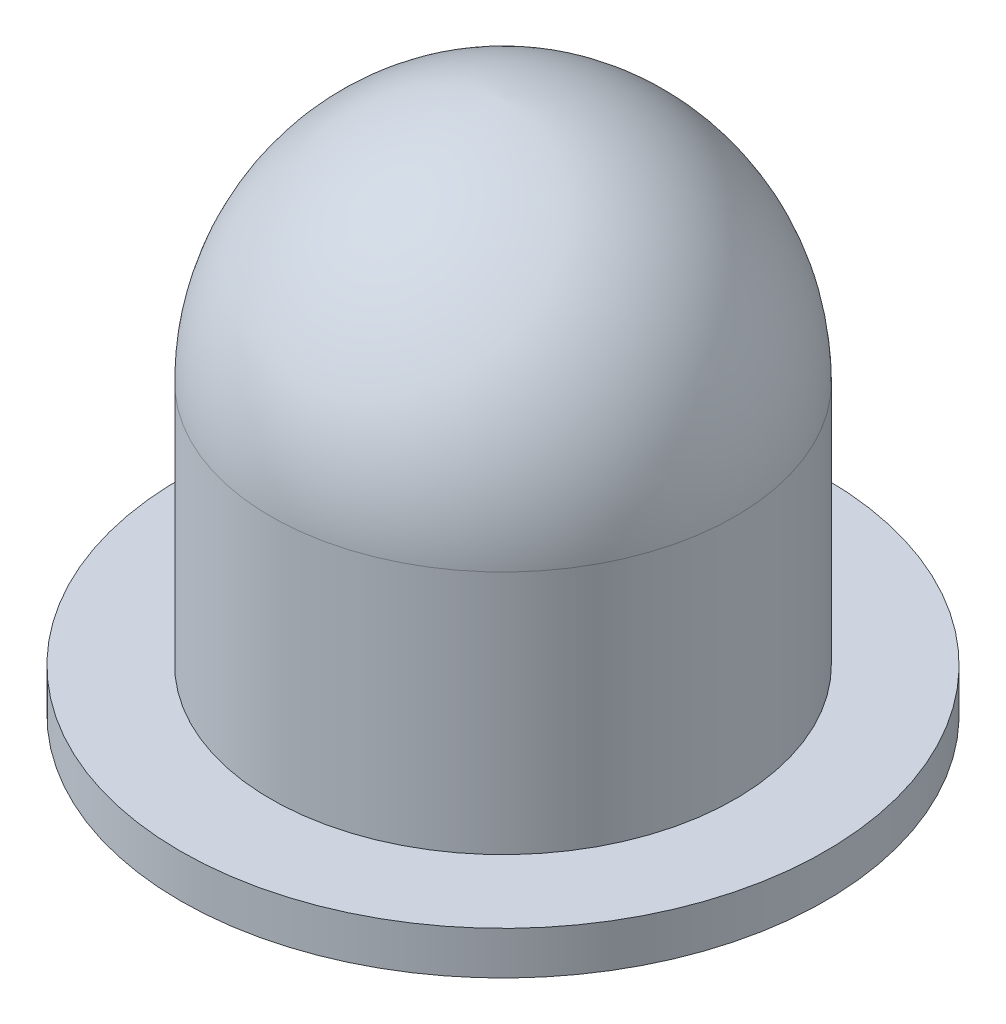
ISO-10303-21;
HEADER;
FILE_DESCRIPTION(('STEP AP214'),'2;1');
FILE_NAME('part.step','',(''),(''),'','','');
FILE_SCHEMA(('AUTOMOTIVE_DESIGN { 1 0 10303 214 1 1 1 1 }'));
ENDSEC;
DATA;
#1=APPLICATION_CONTEXT('core data for automotive mechanical design processes');
#2=APPLICATION_PROTOCOL_DEFINITION('international standard','automotive_design',2000,#1);
#3=PRODUCT_CONTEXT('',#1,'mechanical');
#4=PRODUCT('Part','Part','',(#3));
#5=PRODUCT_RELATED_PRODUCT_CATEGORY('part','',(#4));
#6=PRODUCT_DEFINITION_FORMATION('','',#4);
#7=PRODUCT_DEFINITION_CONTEXT('part definition',#1,'design');
#8=PRODUCT_DEFINITION('design','',#6,#7);
#9=PRODUCT_DEFINITION_SHAPE('','',#8);
#10=(LENGTH_UNIT() NAMED_UNIT(*) SI_UNIT(.MILLI.,.METRE.));
#11=(NAMED_UNIT(*) PLANE_ANGLE_UNIT() SI_UNIT($,.RADIAN.));
#12=(NAMED_UNIT(*) SI_UNIT($,.STERADIAN.) SOLID_ANGLE_UNIT());
#13=UNCERTAINTY_MEASURE_WITH_UNIT(LENGTH_MEASURE(1.E-05),#10,'distance_accuracy_value','');
#14=(GEOMETRIC_REPRESENTATION_CONTEXT(3) GLOBAL_UNCERTAINTY_ASSIGNED_CONTEXT((#13)) GLOBAL_UNIT_ASSIGNED_CONTEXT((#10,
#11,#12)) REPRESENTATION_CONTEXT('',''));
#15=CARTESIAN_POINT('',(0.,0.,0.));
#16=DIRECTION('',(0.,0.,1.));
#17=DIRECTION('',(1.,0.,0.));
#18=AXIS2_PLACEMENT_3D('',#15,#16,#17);
#19=CARTESIAN_POINT('',(0.,48.8417574380002,2.01415848401245));
#20=DIRECTION('',(-1.,0.,0.));
#21=DIRECTION('',(0.,0.,-1.));
#22=AXIS2_PLACEMENT_3D('',#19,#20,#21);
#23=CIRCLE('',#22,36.3041584840124);
#24=TRIMMED_CURVE('',#23,(PARAMETER_VALUE(-1.51528772173753)),
(PARAMETER_VALUE(1.51528772173753)),.T.,.PARAMETER.);
#25=CARTESIAN_POINT('',(0.,48.8417574380002,0.));
#26=DIRECTION('',(0.,-1.,0.));
#27=AXIS1_PLACEMENT('',#25,#26);
#28=SURFACE_OF_REVOLUTION('',#24,#27);
#29=CARTESIAN_POINT('',(0.,48.8417574380002,0.));
#30=DIRECTION('',(0.,-1.,0.));
#31=DIRECTION('',(0.,0.,-1.));
#32=AXIS2_PLACEMENT_3D('',#29,#30,#31);
#33=CIRCLE('',#32,34.29);
#34=CARTESIAN_POINT('',(0.,48.8417574380002,-34.29));
#35=VERTEX_POINT('',#34);
#36=EDGE_CURVE('E93',#35,#35,#33,.T.);
#37=ORIENTED_EDGE('',*,*,#36,.F.);
#38=EDGE_LOOP('',(#37));
#39=FACE_BOUND('',#38,.T.);
#40=CARTESIAN_POINT('',(0.,85.09,0.));
#41=VERTEX_POINT('',#40);
#42=VERTEX_LOOP('',#41);
#43=FACE_BOUND('',#42,.T.);
#44=ADVANCED_FACE('F42',(#39,#43),#28,.T.);
#45=CARTESIAN_POINT('',(0.,0.,0.));
#46=DIRECTION('',(0.,-1.,0.));
#47=DIRECTION('',(0.,0.,-1.));
#48=AXIS2_PLACEMENT_3D('',#45,#46,#47);
#49=CYLINDRICAL_SURFACE('',#48,34.29);
#50=ORIENTED_EDGE('',*,*,#36,.T.);
#51=EDGE_LOOP('',(#50));
#52=FACE_BOUND('',#51,.T.);
#53=CARTESIAN_POINT('',(0.,12.7,0.));
#54=DIRECTION('',(0.,-1.,0.));
#55=DIRECTION('',(0.,0.,-1.));
#56=AXIS2_PLACEMENT_3D('',#53,#54,#55);
#57=CIRCLE('',#56,34.29);
#58=CARTESIAN_POINT('',(0.,12.7,-34.29));
#59=VERTEX_POINT('',#58);
#60=EDGE_CURVE('E50',#59,#59,#57,.T.);
#61=ORIENTED_EDGE('',*,*,#60,.F.);
#62=EDGE_LOOP('',(#61));
#63=FACE_BOUND('',#62,.T.);
#64=ADVANCED_FACE('F55',(#52,#63),#49,.T.);
#65=CARTESIAN_POINT('',(0.,6.35,0.));
#66=DIRECTION('',(0.,-1.,0.));
#67=DIRECTION('',(0.,0.,-1.));
#68=AXIS2_PLACEMENT_3D('',#65,#66,#67);
#69=CIRCLE('',#68,34.29);
#70=CARTESIAN_POINT('',(0.,6.35,-34.29));
#71=VERTEX_POINT('',#70);
#72=EDGE_CURVE('E13',#71,#71,#69,.T.);
#73=ORIENTED_EDGE('',*,*,#72,.T.);
#74=EDGE_LOOP('',(#73));
#75=FACE_BOUND('',#74,.T.);
#76=CARTESIAN_POINT('',(0.,0.,0.));
#77=DIRECTION('',(0.,-1.,0.));
#78=DIRECTION('',(0.,0.,-1.));
#79=AXIS2_PLACEMENT_3D('',#76,#77,#78);
#80=CIRCLE('',#79,34.29);
#81=CARTESIAN_POINT('',(0.,0.,-34.29));
#82=VERTEX_POINT('',#81);
#83=EDGE_CURVE('E89',#82,#82,#80,.T.);
#84=ORIENTED_EDGE('',*,*,#83,.F.);
#85=EDGE_LOOP('',(#84));
#86=FACE_BOUND('',#85,.T.);
#87=ADVANCED_FACE('F62',(#75,#86),#49,.T.);
#88=CARTESIAN_POINT('',(34.29,0.,0.));
#89=DIRECTION('',(0.,1.,0.));
#90=DIRECTION('',(0.,0.,1.));
#91=AXIS2_PLACEMENT_3D('',#88,#89,#90);
#92=PLANE('',#91);
#93=ORIENTED_EDGE('',*,*,#83,.T.);
#94=EDGE_LOOP('',(#93));
#95=FACE_BOUND('',#94,.T.);
#96=ADVANCED_FACE('F77',(#95),#92,.F.);
#97=CARTESIAN_POINT('',(0.,0.,0.));
#98=DIRECTION('',(0.,-1.,0.));
#99=DIRECTION('',(0.,0.,-1.));
#100=AXIS2_PLACEMENT_3D('',#97,#98,#99);
#101=CYLINDRICAL_SURFACE('',#100,47.625);
#102=CARTESIAN_POINT('',(0.,6.35,0.));
#103=DIRECTION('',(0.,-1.,0.));
#104=DIRECTION('',(0.,0.,-1.));
#105=AXIS2_PLACEMENT_3D('',#102,#103,#104);
#106=CIRCLE('',#105,47.625);
#107=CARTESIAN_POINT('',(0.,6.35,-47.625));
#108=VERTEX_POINT('',#107);
#109=EDGE_CURVE('E46',#108,#108,#106,.T.);
#110=ORIENTED_EDGE('',*,*,#109,.F.);
#111=EDGE_LOOP('',(#110));
#112=FACE_BOUND('',#111,.T.);
#113=CARTESIAN_POINT('',(0.,12.7,0.));
#114=DIRECTION('',(0.,-1.,0.));
#115=DIRECTION('',(0.,0.,-1.));
#116=AXIS2_PLACEMENT_3D('',#113,#114,#115);
#117=CIRCLE('',#116,47.625);
#118=CARTESIAN_POINT('',(0.,12.7,-47.625));
#119=VERTEX_POINT('',#118);
#120=EDGE_CURVE('E88',#119,#119,#117,.T.);
#121=ORIENTED_EDGE('',*,*,#120,.T.);
#122=EDGE_LOOP('',(#121));
#123=FACE_BOUND('',#122,.T.);
#124=ADVANCED_FACE('F68',(#112,#123),#101,.T.);
#125=CARTESIAN_POINT('',(34.29,12.7,0.));
#126=DIRECTION('',(0.,-1.,0.));
#127=DIRECTION('',(0.,0.,-1.));
#128=AXIS2_PLACEMENT_3D('',#125,#126,#127);
#129=PLANE('',#128);
#130=ORIENTED_EDGE('',*,*,#120,.F.);
#131=EDGE_LOOP('',(#130));
#132=FACE_BOUND('',#131,.T.);
#133=ORIENTED_EDGE('',*,*,#60,.T.);
#134=EDGE_LOOP('',(#133));
#135=FACE_BOUND('',#134,.T.);
#136=ADVANCED_FACE('F58',(#132,#135),#129,.F.);
#137=CARTESIAN_POINT('',(34.29,6.35,0.));
#138=DIRECTION('',(0.,-1.,0.));
#139=DIRECTION('',(0.,0.,-1.));
#140=AXIS2_PLACEMENT_3D('',#137,#138,#139);
#141=PLANE('',#140);
#142=ORIENTED_EDGE('',*,*,#109,.T.);
#143=EDGE_LOOP('',(#142));
#144=FACE_BOUND('',#143,.T.);
#145=ORIENTED_EDGE('',*,*,#72,.F.);
#146=EDGE_LOOP('',(#145));
#147=FACE_BOUND('',#146,.T.);
#148=ADVANCED_FACE('F44',(#144,#147),#141,.T.);
#149=CLOSED_SHELL('',(#44,#64,#87,#96,#124,#136,#148));
#150=MANIFOLD_SOLID_BREP('B2',#149);
#151=ADVANCED_BREP_SHAPE_REPRESENTATION('',(#18,#150),#14);
#152=SHAPE_DEFINITION_REPRESENTATION(#9,#151);
ENDSEC;
END-ISO-10303-21;
